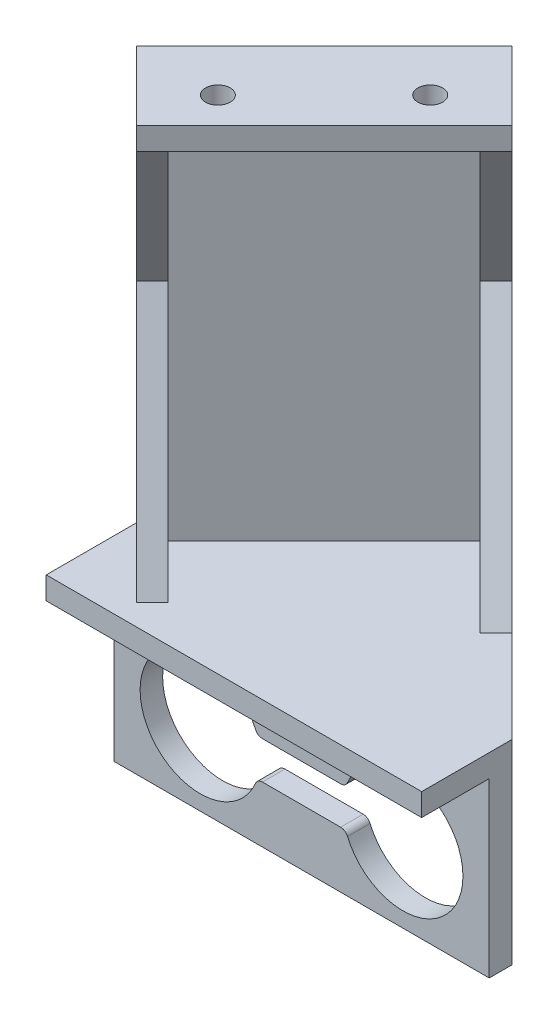
ISO-10303-21;
HEADER;
FILE_DESCRIPTION(('STEP AP214'),'2;1');
FILE_NAME('part.step','',(''),(''),'','','');
FILE_SCHEMA(('AUTOMOTIVE_DESIGN { 1 0 10303 214 1 1 1 1 }'));
ENDSEC;
DATA;
#1=APPLICATION_CONTEXT('core data for automotive mechanical design processes');
#2=APPLICATION_PROTOCOL_DEFINITION('international standard','automotive_design',2000,#1);
#3=PRODUCT_CONTEXT('',#1,'mechanical');
#4=PRODUCT('Part','Part','',(#3));
#5=PRODUCT_RELATED_PRODUCT_CATEGORY('part','',(#4));
#6=PRODUCT_DEFINITION_FORMATION('','',#4);
#7=PRODUCT_DEFINITION_CONTEXT('part definition',#1,'design');
#8=PRODUCT_DEFINITION('design','',#6,#7);
#9=PRODUCT_DEFINITION_SHAPE('','',#8);
#10=(LENGTH_UNIT() NAMED_UNIT(*) SI_UNIT(.MILLI.,.METRE.));
#11=(NAMED_UNIT(*) PLANE_ANGLE_UNIT() SI_UNIT($,.RADIAN.));
#12=(NAMED_UNIT(*) SI_UNIT($,.STERADIAN.) SOLID_ANGLE_UNIT());
#13=UNCERTAINTY_MEASURE_WITH_UNIT(LENGTH_MEASURE(1.E-05),#10,'distance_accuracy_value','');
#14=(GEOMETRIC_REPRESENTATION_CONTEXT(3) GLOBAL_UNCERTAINTY_ASSIGNED_CONTEXT((#13)) GLOBAL_UNIT_ASSIGNED_CONTEXT((#10,
#11,#12)) REPRESENTATION_CONTEXT('',''));
#15=CARTESIAN_POINT('',(0.,0.,0.));
#16=DIRECTION('',(0.,0.,1.));
#17=DIRECTION('',(1.,0.,0.));
#18=AXIS2_PLACEMENT_3D('',#15,#16,#17);
#19=CARTESIAN_POINT('',(2.12132034355976,71.,-22.8786796564402));
#20=DIRECTION('',(0.707106781186548,0.,0.707106781186547));
#21=DIRECTION('',(0.707106781186547,0.,-0.707106781186548));
#22=AXIS2_PLACEMENT_3D('',#19,#20,#21);
#23=PLANE('',#22);
#24=DIRECTION('',(0.707106781186547,0.,-0.707106781186548));
#25=VECTOR('',#24,1.);
#26=CARTESIAN_POINT('',(1.23165366794353E-13,68.,-20.7573593128806));
#27=LINE('',#26,#25);
#28=CARTESIAN_POINT('',(-20.7573593128806,68.,1.30537941567255E-13));
#29=VERTEX_POINT('',#28);
#30=CARTESIAN_POINT('',(1.22506171873482E-13,68.,-20.7573593128806));
#31=VERTEX_POINT('',#30);
#32=EDGE_CURVE('E300',#29,#31,#27,.T.);
#33=ORIENTED_EDGE('',*,*,#32,.F.);
#34=DIRECTION('',(0.,1.,0.));
#35=VECTOR('',#34,1.);
#36=CARTESIAN_POINT('',(-20.7573593128806,0.,1.22731685925359E-13));
#37=LINE('',#36,#35);
#38=CARTESIAN_POINT('',(-20.7573593128806,46.,1.24032728532342E-13));
#39=VERTEX_POINT('',#38);
#40=EDGE_CURVE('E571',#39,#29,#37,.T.);
#41=ORIENTED_EDGE('',*,*,#40,.F.);
#42=DIRECTION('',(0.,1.,0.));
#43=VECTOR('',#42,1.);
#44=CARTESIAN_POINT('',(-20.7573593128806,0.,1.22731685925359E-13));
#45=LINE('',#44,#43);
#46=CARTESIAN_POINT('',(-20.7573593128806,16.,1.27502175484295E-13));
#47=VERTEX_POINT('',#46);
#48=EDGE_CURVE('E561',#47,#39,#45,.T.);
#49=ORIENTED_EDGE('',*,*,#48,.F.);
#50=DIRECTION('',(-0.707106781186547,0.,0.707106781186548));
#51=VECTOR('',#50,1.);
#52=CARTESIAN_POINT('',(2.12132034355977,16.,-22.8786796564402));
#53=LINE('',#52,#51);
#54=CARTESIAN_POINT('',(0.,16.,-20.7573593128805));
#55=VERTEX_POINT('',#54);
#56=EDGE_CURVE('E308',#55,#47,#53,.T.);
#57=ORIENTED_EDGE('',*,*,#56,.F.);
#58=DIRECTION('',(0.,-1.,0.));
#59=VECTOR('',#58,1.);
#60=CARTESIAN_POINT('',(0.,0.,-20.7573593128805));
#61=LINE('',#60,#59);
#62=CARTESIAN_POINT('',(0.,46.,-20.7573593128805));
#63=VERTEX_POINT('',#62);
#64=EDGE_CURVE('E519',#63,#55,#61,.T.);
#65=ORIENTED_EDGE('',*,*,#64,.F.);
#66=DIRECTION('',(0.,-1.,0.));
#67=VECTOR('',#66,1.);
#68=CARTESIAN_POINT('',(0.,0.,-20.7573593128805));
#69=LINE('',#68,#67);
#70=EDGE_CURVE('E517',#31,#63,#69,.T.);
#71=ORIENTED_EDGE('',*,*,#70,.F.);
#72=EDGE_LOOP('',(#33,#41,#49,#57,#65,#71));
#73=FACE_BOUND('',#72,.T.);
#74=ADVANCED_FACE('F77',(#73),#23,.T.);
#75=CARTESIAN_POINT('',(7.0710678118656,68.,-13.6862915010151));
#76=DIRECTION('',(0.,1.,0.));
#77=DIRECTION('',(-1.,0.,0.));
#78=AXIS2_PLACEMENT_3D('',#75,#76,#77);
#79=PLANE('',#78);
#80=CARTESIAN_POINT('',(0.227922061357971,68.,-13.914213562373));
#81=DIRECTION('',(0.,-1.,0.));
#82=DIRECTION('',(0.,0.,-1.));
#83=AXIS2_PLACEMENT_3D('',#80,#81,#82);
#84=CIRCLE('',#83,1.65);
#85=CARTESIAN_POINT('',(0.227922061357971,68.,-15.564213562373));
#86=VERTEX_POINT('',#85);
#87=EDGE_CURVE('E590',#86,#86,#84,.T.);
#88=ORIENTED_EDGE('',*,*,#87,.F.);
#89=EDGE_LOOP('',(#88));
#90=FACE_BOUND('',#89,.T.);
#91=CARTESIAN_POINT('',(-13.914213562373,68.,0.227922061357981));
#92=DIRECTION('',(0.,-1.,0.));
#93=DIRECTION('',(0.,0.,-1.));
#94=AXIS2_PLACEMENT_3D('',#91,#92,#93);
#95=CIRCLE('',#94,1.65);
#96=CARTESIAN_POINT('',(-13.914213562373,68.,-1.42207793864202));
#97=VERTEX_POINT('',#96);
#98=EDGE_CURVE('E584',#97,#97,#95,.T.);
#99=ORIENTED_EDGE('',*,*,#98,.F.);
#100=EDGE_LOOP('',(#99));
#101=FACE_BOUND('',#100,.T.);
#102=DIRECTION('',(0.707106781186549,0.,0.707106781186547));
#103=VECTOR('',#102,1.);
#104=CARTESIAN_POINT('',(-10.3786796564403,68.,10.3786796564404));
#105=LINE('',#104,#103);
#106=CARTESIAN_POINT('',(-13.6862915010151,68.,7.0710678118656));
#107=VERTEX_POINT('',#106);
#108=EDGE_CURVE('E293',#29,#107,#105,.T.);
#109=ORIENTED_EDGE('',*,*,#108,.F.);
#110=ORIENTED_EDGE('',*,*,#32,.T.);
#111=DIRECTION('',(-0.707106781186548,0.,-0.707106781186547));
#112=VECTOR('',#111,1.);
#113=CARTESIAN_POINT('',(7.0710678118656,68.,-13.6862915010151));
#114=LINE('',#113,#112);
#115=CARTESIAN_POINT('',(7.0710678118656,68.,-13.6862915010151));
#116=VERTEX_POINT('',#115);
#117=EDGE_CURVE('E283',#116,#31,#114,.T.);
#118=ORIENTED_EDGE('',*,*,#117,.F.);
#119=DIRECTION('',(0.707106781186547,0.,-0.707106781186548));
#120=VECTOR('',#119,1.);
#121=CARTESIAN_POINT('',(7.0710678118656,68.,-13.6862915010151));
#122=LINE('',#121,#120);
#123=EDGE_CURVE('E284',#107,#116,#122,.T.);
#124=ORIENTED_EDGE('',*,*,#123,.F.);
#125=EDGE_LOOP('',(#109,#110,#118,#124));
#126=FACE_BOUND('',#125,.T.);
#127=ADVANCED_FACE('F605',(#90,#101,#126),#79,.F.);
#128=CARTESIAN_POINT('',(0.,16.,0.));
#129=DIRECTION('',(0.,1.,0.));
#130=DIRECTION('',(-1.,0.,0.));
#131=AXIS2_PLACEMENT_3D('',#128,#129,#130);
#132=PLANE('',#131);
#133=ORIENTED_EDGE('',*,*,#56,.T.);
#134=DIRECTION('',(0.707106781186549,0.,0.707106781186547));
#135=VECTOR('',#134,1.);
#136=CARTESIAN_POINT('',(-10.3786796564403,16.,10.3786796564404));
#137=LINE('',#136,#135);
#138=CARTESIAN_POINT('',(-13.6862915010151,16.,7.0710678118656));
#139=VERTEX_POINT('',#138);
#140=EDGE_CURVE('E92',#47,#139,#137,.T.);
#141=ORIENTED_EDGE('',*,*,#140,.T.);
#142=DIRECTION('',(-0.707106781186546,0.,0.707106781186548));
#143=VECTOR('',#142,1.);
#144=CARTESIAN_POINT('',(-13.6862915010151,16.,7.07106781186559));
#145=LINE('',#144,#143);
#146=CARTESIAN_POINT('',(-15.8076118445747,16.,9.19238815542524));
#147=VERTEX_POINT('',#146);
#148=EDGE_CURVE('E574',#139,#147,#145,.T.);
#149=ORIENTED_EDGE('',*,*,#148,.T.);
#150=DIRECTION('',(0.707106781186549,0.,0.707106781186546));
#151=VECTOR('',#150,1.);
#152=CARTESIAN_POINT('',(-25.,16.,0.));
#153=LINE('',#152,#151);
#154=CARTESIAN_POINT('',(-25.,16.,0.));
#155=VERTEX_POINT('',#154);
#156=EDGE_CURVE('E100',#155,#147,#153,.T.);
#157=ORIENTED_EDGE('',*,*,#156,.F.);
#158=DIRECTION('',(0.,0.,1.));
#159=VECTOR('',#158,1.);
#160=CARTESIAN_POINT('',(-25.,16.,0.));
#161=LINE('',#160,#159);
#162=CARTESIAN_POINT('',(-25.,16.,12.));
#163=VERTEX_POINT('',#162);
#164=EDGE_CURVE('E345',#155,#163,#161,.T.);
#165=ORIENTED_EDGE('',*,*,#164,.T.);
#166=DIRECTION('',(1.,0.,0.));
#167=VECTOR('',#166,1.);
#168=CARTESIAN_POINT('',(-25.,16.,12.));
#169=LINE('',#168,#167);
#170=CARTESIAN_POINT('',(25.,16.,12.));
#171=VERTEX_POINT('',#170);
#172=EDGE_CURVE('E348',#163,#171,#169,.T.);
#173=ORIENTED_EDGE('',*,*,#172,.T.);
#174=DIRECTION('',(0.,0.,-1.));
#175=VECTOR('',#174,1.);
#176=CARTESIAN_POINT('',(25.,16.,0.));
#177=LINE('',#176,#175);
#178=CARTESIAN_POINT('',(25.,16.,0.));
#179=VERTEX_POINT('',#178);
#180=EDGE_CURVE('E350',#171,#179,#177,.T.);
#181=ORIENTED_EDGE('',*,*,#180,.T.);
#182=DIRECTION('',(-0.707106781186551,0.,-0.707106781186544));
#183=VECTOR('',#182,1.);
#184=CARTESIAN_POINT('',(25.,16.,0.));
#185=LINE('',#184,#183);
#186=CARTESIAN_POINT('',(12.7279220613579,16.,-12.272077938642));
#187=VERTEX_POINT('',#186);
#188=EDGE_CURVE('E319',#179,#187,#185,.T.);
#189=ORIENTED_EDGE('',*,*,#188,.T.);
#190=DIRECTION('',(0.707106781186544,0.,-0.707106781186551));
#191=VECTOR('',#190,1.);
#192=CARTESIAN_POINT('',(10.6066017177983,16.,-10.1507575950823));
#193=LINE('',#192,#191);
#194=CARTESIAN_POINT('',(10.6066017177983,16.,-10.1507575950823));
#195=VERTEX_POINT('',#194);
#196=EDGE_CURVE('E305',#195,#187,#193,.T.);
#197=ORIENTED_EDGE('',*,*,#196,.F.);
#198=DIRECTION('',(0.707106781186551,0.,0.707106781186544));
#199=VECTOR('',#198,1.);
#200=CARTESIAN_POINT('',(10.3786796564402,16.,-10.3786796564403));
#201=LINE('',#200,#199);
#202=EDGE_CURVE('E537',#55,#195,#201,.T.);
#203=ORIENTED_EDGE('',*,*,#202,.F.);
#204=EDGE_LOOP('',(#133,#141,#149,#157,#165,#173,#181,#189,#197,#203));
#205=FACE_BOUND('',#204,.T.);
#206=ADVANCED_FACE('F492',(#205),#132,.T.);
#207=CARTESIAN_POINT('',(-25.,16.,12.));
#208=DIRECTION('',(0.,0.,-1.));
#209=DIRECTION('',(-1.,0.,0.));
#210=AXIS2_PLACEMENT_3D('',#207,#208,#209);
#211=PLANE('',#210);
#212=DIRECTION('',(-1.,0.,0.));
#213=VECTOR('',#212,1.);
#214=CARTESIAN_POINT('',(25.,13.,12.));
#215=LINE('',#214,#213);
#216=CARTESIAN_POINT('',(25.,13.,12.));
#217=VERTEX_POINT('',#216);
#218=CARTESIAN_POINT('',(-25.,13.,12.));
#219=VERTEX_POINT('',#218);
#220=EDGE_CURVE('E337',#217,#219,#215,.T.);
#221=ORIENTED_EDGE('',*,*,#220,.F.);
#222=DIRECTION('',(0.,-1.,0.));
#223=VECTOR('',#222,1.);
#224=CARTESIAN_POINT('',(25.,16.,12.));
#225=LINE('',#224,#223);
#226=EDGE_CURVE('E353',#171,#217,#225,.T.);
#227=ORIENTED_EDGE('',*,*,#226,.F.);
#228=ORIENTED_EDGE('',*,*,#172,.F.);
#229=DIRECTION('',(0.,-1.,0.));
#230=VECTOR('',#229,1.);
#231=CARTESIAN_POINT('',(-25.,16.,12.));
#232=LINE('',#231,#230);
#233=EDGE_CURVE('E356',#163,#219,#232,.T.);
#234=ORIENTED_EDGE('',*,*,#233,.T.);
#235=EDGE_LOOP('',(#221,#227,#228,#234));
#236=FACE_BOUND('',#235,.T.);
#237=ADVANCED_FACE('F498',(#236),#211,.F.);
#238=CARTESIAN_POINT('',(0.,0.,3.));
#239=DIRECTION('',(0.,0.,1.));
#240=DIRECTION('',(1.,0.,0.));
#241=AXIS2_PLACEMENT_3D('',#238,#239,#240);
#242=PLANE('',#241);
#243=DIRECTION('',(0.,-1.,0.));
#244=VECTOR('',#243,1.);
#245=CARTESIAN_POINT('',(-25.,-10.,3.));
#246=LINE('',#245,#244);
#247=CARTESIAN_POINT('',(-25.,13.,3.));
#248=VERTEX_POINT('',#247);
#249=CARTESIAN_POINT('',(-25.,-10.,3.));
#250=VERTEX_POINT('',#249);
#251=EDGE_CURVE('E450',#248,#250,#246,.T.);
#252=ORIENTED_EDGE('',*,*,#251,.T.);
#253=DIRECTION('',(1.,0.,0.));
#254=VECTOR('',#253,1.);
#255=CARTESIAN_POINT('',(25.,-10.,3.));
#256=LINE('',#255,#254);
#257=CARTESIAN_POINT('',(25.,-10.,3.));
#258=VERTEX_POINT('',#257);
#259=EDGE_CURVE('E453',#250,#258,#256,.T.);
#260=ORIENTED_EDGE('',*,*,#259,.T.);
#261=DIRECTION('',(0.,1.,0.));
#262=VECTOR('',#261,1.);
#263=CARTESIAN_POINT('',(25.,-10.,3.));
#264=LINE('',#263,#262);
#265=CARTESIAN_POINT('',(25.,13.,3.));
#266=VERTEX_POINT('',#265);
#267=EDGE_CURVE('E456',#258,#266,#264,.T.);
#268=ORIENTED_EDGE('',*,*,#267,.T.);
#269=DIRECTION('',(1.,0.,0.));
#270=VECTOR('',#269,1.);
#271=CARTESIAN_POINT('',(25.,13.,3.));
#272=LINE('',#271,#270);
#273=EDGE_CURVE('E342',#248,#266,#272,.T.);
#274=ORIENTED_EDGE('',*,*,#273,.F.);
#275=EDGE_LOOP('',(#252,#260,#268,#274));
#276=FACE_BOUND('',#275,.T.);
#277=CARTESIAN_POINT('',(13.5,0.,3.));
#278=DIRECTION('',(0.,0.,1.));
#279=DIRECTION('',(1.,0.,0.));
#280=AXIS2_PLACEMENT_3D('',#277,#278,#279);
#281=CIRCLE('',#280,8.);
#282=CARTESIAN_POINT('',(6.12972268809911,-3.11111111111111,3.));
#283=VERTEX_POINT('',#282);
#284=CARTESIAN_POINT('',(6.12972268809911,3.11111111111111,3.));
#285=VERTEX_POINT('',#284);
#286=EDGE_CURVE('E393',#283,#285,#281,.T.);
#287=ORIENTED_EDGE('',*,*,#286,.F.);
#288=CARTESIAN_POINT('',(5.2084380241115,-3.5,3.));
#289=DIRECTION('',(0.,0.,-1.));
#290=DIRECTION('',(-1.,0.,0.));
#291=AXIS2_PLACEMENT_3D('',#288,#289,#290);
#292=CIRCLE('',#291,1.);
#293=CARTESIAN_POINT('',(5.2084380241115,-2.5,3.));
#294=VERTEX_POINT('',#293);
#295=EDGE_CURVE('E391',#294,#283,#292,.T.);
#296=ORIENTED_EDGE('',*,*,#295,.F.);
#297=DIRECTION('',(1.,0.,0.));
#298=VECTOR('',#297,1.);
#299=CARTESIAN_POINT('',(5.2084380241115,-2.5,3.));
#300=LINE('',#299,#298);
#301=CARTESIAN_POINT('',(-5.2084380241115,-2.5,3.));
#302=VERTEX_POINT('',#301);
#303=EDGE_CURVE('E407',#302,#294,#300,.T.);
#304=ORIENTED_EDGE('',*,*,#303,.F.);
#305=CARTESIAN_POINT('',(-5.2084380241115,-3.5,3.));
#306=DIRECTION('',(0.,0.,-1.));
#307=DIRECTION('',(1.,0.,0.));
#308=AXIS2_PLACEMENT_3D('',#305,#306,#307);
#309=CIRCLE('',#308,1.);
#310=CARTESIAN_POINT('',(-6.12972268809911,-3.11111111111111,3.));
#311=VERTEX_POINT('',#310);
#312=EDGE_CURVE('E404',#311,#302,#309,.T.);
#313=ORIENTED_EDGE('',*,*,#312,.F.);
#314=CARTESIAN_POINT('',(-13.5,0.,3.));
#315=DIRECTION('',(0.,0.,1.));
#316=DIRECTION('',(1.,0.,0.));
#317=AXIS2_PLACEMENT_3D('',#314,#315,#316);
#318=CIRCLE('',#317,8.);
#319=CARTESIAN_POINT('',(-6.12972268809911,3.11111111111111,3.));
#320=VERTEX_POINT('',#319);
#321=EDGE_CURVE('E402',#320,#311,#318,.T.);
#322=ORIENTED_EDGE('',*,*,#321,.F.);
#323=CARTESIAN_POINT('',(-5.2084380241115,3.5,3.));
#324=DIRECTION('',(0.,0.,-1.));
#325=DIRECTION('',(-1.,0.,0.));
#326=AXIS2_PLACEMENT_3D('',#323,#324,#325);
#327=CIRCLE('',#326,1.);
#328=CARTESIAN_POINT('',(-5.2084380241115,2.5,3.));
#329=VERTEX_POINT('',#328);
#330=EDGE_CURVE('E400',#329,#320,#327,.T.);
#331=ORIENTED_EDGE('',*,*,#330,.F.);
#332=DIRECTION('',(-1.,0.,0.));
#333=VECTOR('',#332,1.);
#334=CARTESIAN_POINT('',(-5.2084380241115,2.5,3.));
#335=LINE('',#334,#333);
#336=CARTESIAN_POINT('',(5.2084380241115,2.5,3.));
#337=VERTEX_POINT('',#336);
#338=EDGE_CURVE('E398',#337,#329,#335,.T.);
#339=ORIENTED_EDGE('',*,*,#338,.F.);
#340=CARTESIAN_POINT('',(5.2084380241115,3.5,3.));
#341=DIRECTION('',(0.,0.,-1.));
#342=DIRECTION('',(1.,0.,0.));
#343=AXIS2_PLACEMENT_3D('',#340,#341,#342);
#344=CIRCLE('',#343,1.);
#345=EDGE_CURVE('E396',#285,#337,#344,.T.);
#346=ORIENTED_EDGE('',*,*,#345,.F.);
#347=EDGE_LOOP('',(#287,#296,#304,#313,#322,#331,#339,#346));
#348=FACE_BOUND('',#347,.T.);
#349=DIRECTION('',(-1.,0.,0.));
#350=VECTOR('',#349,1.);
#351=CARTESIAN_POINT('',(3.25,9.,3.));
#352=LINE('',#351,#350);
#353=CARTESIAN_POINT('',(3.25,9.,3.));
#354=VERTEX_POINT('',#353);
#355=CARTESIAN_POINT('',(-3.25,9.,3.));
#356=VERTEX_POINT('',#355);
#357=EDGE_CURVE('E362',#354,#356,#352,.T.);
#358=ORIENTED_EDGE('',*,*,#357,.F.);
#359=CARTESIAN_POINT('',(3.25,7.25,3.));
#360=DIRECTION('',(0.,0.,1.));
#361=DIRECTION('',(1.,0.,0.));
#362=AXIS2_PLACEMENT_3D('',#359,#360,#361);
#363=CIRCLE('',#362,1.75);
#364=CARTESIAN_POINT('',(3.25,5.5,3.));
#365=VERTEX_POINT('',#364);
#366=EDGE_CURVE('E360',#365,#354,#363,.T.);
#367=ORIENTED_EDGE('',*,*,#366,.F.);
#368=DIRECTION('',(1.,0.,0.));
#369=VECTOR('',#368,1.);
#370=CARTESIAN_POINT('',(3.25,5.5,3.));
#371=LINE('',#370,#369);
#372=CARTESIAN_POINT('',(-3.25,5.5,3.));
#373=VERTEX_POINT('',#372);
#374=EDGE_CURVE('E368',#373,#365,#371,.T.);
#375=ORIENTED_EDGE('',*,*,#374,.F.);
#376=CARTESIAN_POINT('',(-3.25,7.25,3.));
#377=DIRECTION('',(0.,0.,1.));
#378=DIRECTION('',(1.,0.,0.));
#379=AXIS2_PLACEMENT_3D('',#376,#377,#378);
#380=CIRCLE('',#379,1.75);
#381=EDGE_CURVE('E365',#356,#373,#380,.T.);
#382=ORIENTED_EDGE('',*,*,#381,.F.);
#383=EDGE_LOOP('',(#358,#367,#375,#382));
#384=FACE_BOUND('',#383,.T.);
#385=ADVANCED_FACE('F504',(#276,#348,#384),#242,.T.);
#386=CARTESIAN_POINT('',(0.,0.,0.));
#387=DIRECTION('',(0.,0.,1.));
#388=DIRECTION('',(1.,0.,0.));
#389=AXIS2_PLACEMENT_3D('',#386,#387,#388);
#390=PLANE('',#389);
#391=CARTESIAN_POINT('',(5.2084380241115,-3.5,0.));
#392=DIRECTION('',(0.,0.,-1.));
#393=DIRECTION('',(-1.,0.,0.));
#394=AXIS2_PLACEMENT_3D('',#391,#392,#393);
#395=CIRCLE('',#394,1.);
#396=CARTESIAN_POINT('',(5.2084380241115,-2.5,0.));
#397=VERTEX_POINT('',#396);
#398=CARTESIAN_POINT('',(6.12972268809911,-3.11111111111111,0.));
#399=VERTEX_POINT('',#398);
#400=EDGE_CURVE('E390',#397,#399,#395,.T.);
#401=ORIENTED_EDGE('',*,*,#400,.T.);
#402=CARTESIAN_POINT('',(13.5,0.,0.));
#403=DIRECTION('',(0.,0.,1.));
#404=DIRECTION('',(1.,0.,0.));
#405=AXIS2_PLACEMENT_3D('',#402,#403,#404);
#406=CIRCLE('',#405,8.);
#407=CARTESIAN_POINT('',(6.12972268809911,3.11111111111111,0.));
#408=VERTEX_POINT('',#407);
#409=EDGE_CURVE('E412',#399,#408,#406,.T.);
#410=ORIENTED_EDGE('',*,*,#409,.T.);
#411=CARTESIAN_POINT('',(5.2084380241115,3.5,0.));
#412=DIRECTION('',(0.,0.,-1.));
#413=DIRECTION('',(1.,0.,0.));
#414=AXIS2_PLACEMENT_3D('',#411,#412,#413);
#415=CIRCLE('',#414,1.);
#416=CARTESIAN_POINT('',(5.2084380241115,2.5,0.));
#417=VERTEX_POINT('',#416);
#418=EDGE_CURVE('E415',#408,#417,#415,.T.);
#419=ORIENTED_EDGE('',*,*,#418,.T.);
#420=DIRECTION('',(-1.,0.,0.));
#421=VECTOR('',#420,1.);
#422=CARTESIAN_POINT('',(-5.2084380241115,2.5,0.));
#423=LINE('',#422,#421);
#424=CARTESIAN_POINT('',(-5.2084380241115,2.5,0.));
#425=VERTEX_POINT('',#424);
#426=EDGE_CURVE('E418',#417,#425,#423,.T.);
#427=ORIENTED_EDGE('',*,*,#426,.T.);
#428=CARTESIAN_POINT('',(-5.2084380241115,3.5,0.));
#429=DIRECTION('',(0.,0.,-1.));
#430=DIRECTION('',(-1.,0.,0.));
#431=AXIS2_PLACEMENT_3D('',#428,#429,#430);
#432=CIRCLE('',#431,1.);
#433=CARTESIAN_POINT('',(-6.12972268809911,3.11111111111111,0.));
#434=VERTEX_POINT('',#433);
#435=EDGE_CURVE('E421',#425,#434,#432,.T.);
#436=ORIENTED_EDGE('',*,*,#435,.T.);
#437=CARTESIAN_POINT('',(-13.5,0.,0.));
#438=DIRECTION('',(0.,0.,1.));
#439=DIRECTION('',(1.,0.,0.));
#440=AXIS2_PLACEMENT_3D('',#437,#438,#439);
#441=CIRCLE('',#440,8.);
#442=CARTESIAN_POINT('',(-6.12972268809911,-3.11111111111111,0.));
#443=VERTEX_POINT('',#442);
#444=EDGE_CURVE('E424',#434,#443,#441,.T.);
#445=ORIENTED_EDGE('',*,*,#444,.T.);
#446=CARTESIAN_POINT('',(-5.2084380241115,-3.5,0.));
#447=DIRECTION('',(0.,0.,-1.));
#448=DIRECTION('',(1.,0.,0.));
#449=AXIS2_PLACEMENT_3D('',#446,#447,#448);
#450=CIRCLE('',#449,1.);
#451=CARTESIAN_POINT('',(-5.2084380241115,-2.5,0.));
#452=VERTEX_POINT('',#451);
#453=EDGE_CURVE('E427',#443,#452,#450,.T.);
#454=ORIENTED_EDGE('',*,*,#453,.T.);
#455=DIRECTION('',(1.,0.,0.));
#456=VECTOR('',#455,1.);
#457=CARTESIAN_POINT('',(5.2084380241115,-2.5,0.));
#458=LINE('',#457,#456);
#459=EDGE_CURVE('E394',#452,#397,#458,.T.);
#460=ORIENTED_EDGE('',*,*,#459,.T.);
#461=EDGE_LOOP('',(#401,#410,#419,#427,#436,#445,#454,#460));
#462=FACE_BOUND('',#461,.T.);
#463=DIRECTION('',(0.,-1.,0.));
#464=VECTOR('',#463,1.);
#465=CARTESIAN_POINT('',(-25.,-10.,0.));
#466=LINE('',#465,#464);
#467=CARTESIAN_POINT('',(-25.,13.,0.));
#468=VERTEX_POINT('',#467);
#469=CARTESIAN_POINT('',(-25.,-10.,0.));
#470=VERTEX_POINT('',#469);
#471=EDGE_CURVE('E449',#468,#470,#466,.T.);
#472=ORIENTED_EDGE('',*,*,#471,.F.);
#473=DIRECTION('',(1.,0.,0.));
#474=VECTOR('',#473,1.);
#475=CARTESIAN_POINT('',(25.,13.,0.));
#476=LINE('',#475,#474);
#477=CARTESIAN_POINT('',(25.,13.,0.));
#478=VERTEX_POINT('',#477);
#479=EDGE_CURVE('E320',#468,#478,#476,.T.);
#480=ORIENTED_EDGE('',*,*,#479,.T.);
#481=DIRECTION('',(0.,1.,0.));
#482=VECTOR('',#481,1.);
#483=CARTESIAN_POINT('',(25.,-10.,0.));
#484=LINE('',#483,#482);
#485=CARTESIAN_POINT('',(25.,-10.,0.));
#486=VERTEX_POINT('',#485);
#487=EDGE_CURVE('E454',#486,#478,#484,.T.);
#488=ORIENTED_EDGE('',*,*,#487,.F.);
#489=DIRECTION('',(1.,0.,0.));
#490=VECTOR('',#489,1.);
#491=CARTESIAN_POINT('',(25.,-10.,0.));
#492=LINE('',#491,#490);
#493=EDGE_CURVE('E461',#470,#486,#492,.T.);
#494=ORIENTED_EDGE('',*,*,#493,.F.);
#495=EDGE_LOOP('',(#472,#480,#488,#494));
#496=FACE_BOUND('',#495,.T.);
#497=CARTESIAN_POINT('',(3.25,7.25,0.));
#498=DIRECTION('',(0.,0.,1.));
#499=DIRECTION('',(1.,0.,0.));
#500=AXIS2_PLACEMENT_3D('',#497,#498,#499);
#501=CIRCLE('',#500,1.75);
#502=CARTESIAN_POINT('',(3.25,5.5,0.));
#503=VERTEX_POINT('',#502);
#504=CARTESIAN_POINT('',(3.25,9.,0.));
#505=VERTEX_POINT('',#504);
#506=EDGE_CURVE('E359',#503,#505,#501,.T.);
#507=ORIENTED_EDGE('',*,*,#506,.T.);
#508=DIRECTION('',(-1.,0.,0.));
#509=VECTOR('',#508,1.);
#510=CARTESIAN_POINT('',(3.25,9.,0.));
#511=LINE('',#510,#509);
#512=CARTESIAN_POINT('',(-3.25,9.,0.));
#513=VERTEX_POINT('',#512);
#514=EDGE_CURVE('E373',#505,#513,#511,.T.);
#515=ORIENTED_EDGE('',*,*,#514,.T.);
#516=CARTESIAN_POINT('',(-3.25,7.25,0.));
#517=DIRECTION('',(0.,0.,1.));
#518=DIRECTION('',(1.,0.,0.));
#519=AXIS2_PLACEMENT_3D('',#516,#517,#518);
#520=CIRCLE('',#519,1.75);
#521=CARTESIAN_POINT('',(-3.25,5.5,0.));
#522=VERTEX_POINT('',#521);
#523=EDGE_CURVE('E376',#513,#522,#520,.T.);
#524=ORIENTED_EDGE('',*,*,#523,.T.);
#525=DIRECTION('',(1.,0.,0.));
#526=VECTOR('',#525,1.);
#527=CARTESIAN_POINT('',(3.25,5.5,0.));
#528=LINE('',#527,#526);
#529=EDGE_CURVE('E363',#522,#503,#528,.T.);
#530=ORIENTED_EDGE('',*,*,#529,.T.);
#531=EDGE_LOOP('',(#507,#515,#524,#530));
#532=FACE_BOUND('',#531,.T.);
#533=ADVANCED_FACE('F475',(#462,#496,#532),#390,.F.);
#534=CARTESIAN_POINT('',(-25.,-10.,3.));
#535=DIRECTION('',(1.,0.,0.));
#536=DIRECTION('',(0.,0.,-1.));
#537=AXIS2_PLACEMENT_3D('',#534,#535,#536);
#538=PLANE('',#537);
#539=ORIENTED_EDGE('',*,*,#251,.F.);
#540=DIRECTION('',(0.,0.,-1.));
#541=VECTOR('',#540,1.);
#542=CARTESIAN_POINT('',(-25.,13.,3.));
#543=LINE('',#542,#541);
#544=EDGE_CURVE('E339',#219,#248,#543,.T.);
#545=ORIENTED_EDGE('',*,*,#544,.F.);
#546=ORIENTED_EDGE('',*,*,#233,.F.);
#547=ORIENTED_EDGE('',*,*,#164,.F.);
#548=EDGE_CURVE('E458',#155,#468,#466,.T.);
#549=ORIENTED_EDGE('',*,*,#548,.T.);
#550=ORIENTED_EDGE('',*,*,#471,.T.);
#551=DIRECTION('',(0.,0.,-1.));
#552=VECTOR('',#551,1.);
#553=CARTESIAN_POINT('',(-25.,-10.,3.));
#554=LINE('',#553,#552);
#555=EDGE_CURVE('E12',#250,#470,#554,.T.);
#556=ORIENTED_EDGE('',*,*,#555,.F.);
#557=EDGE_LOOP('',(#539,#545,#546,#547,#549,#550,#556));
#558=FACE_BOUND('',#557,.T.);
#559=ADVANCED_FACE('F79',(#558),#538,.F.);
#560=CARTESIAN_POINT('',(25.,-10.,3.));
#561=DIRECTION('',(0.,1.,0.));
#562=DIRECTION('',(-1.,0.,0.));
#563=AXIS2_PLACEMENT_3D('',#560,#561,#562);
#564=PLANE('',#563);
#565=ORIENTED_EDGE('',*,*,#493,.T.);
#566=DIRECTION('',(0.,0.,-1.));
#567=VECTOR('',#566,1.);
#568=CARTESIAN_POINT('',(25.,-10.,3.));
#569=LINE('',#568,#567);
#570=EDGE_CURVE('E85',#258,#486,#569,.T.);
#571=ORIENTED_EDGE('',*,*,#570,.F.);
#572=ORIENTED_EDGE('',*,*,#259,.F.);
#573=ORIENTED_EDGE('',*,*,#555,.T.);
#574=EDGE_LOOP('',(#565,#571,#572,#573));
#575=FACE_BOUND('',#574,.T.);
#576=ADVANCED_FACE('F507',(#575),#564,.F.);
#577=CARTESIAN_POINT('',(25.,-10.,3.));
#578=DIRECTION('',(-1.,0.,0.));
#579=DIRECTION('',(0.,0.,1.));
#580=AXIS2_PLACEMENT_3D('',#577,#578,#579);
#581=PLANE('',#580);
#582=DIRECTION('',(0.,0.,1.));
#583=VECTOR('',#582,1.);
#584=CARTESIAN_POINT('',(25.,13.,3.));
#585=LINE('',#584,#583);
#586=EDGE_CURVE('E333',#266,#217,#585,.T.);
#587=ORIENTED_EDGE('',*,*,#586,.F.);
#588=ORIENTED_EDGE('',*,*,#267,.F.);
#589=ORIENTED_EDGE('',*,*,#570,.T.);
#590=ORIENTED_EDGE('',*,*,#487,.T.);
#591=DIRECTION('',(0.,1.,0.));
#592=VECTOR('',#591,1.);
#593=CARTESIAN_POINT('',(25.,13.,0.));
#594=LINE('',#593,#592);
#595=EDGE_CURVE('E329',#478,#179,#594,.T.);
#596=ORIENTED_EDGE('',*,*,#595,.T.);
#597=ORIENTED_EDGE('',*,*,#180,.F.);
#598=ORIENTED_EDGE('',*,*,#226,.T.);
#599=EDGE_LOOP('',(#587,#588,#589,#590,#596,#597,#598));
#600=FACE_BOUND('',#599,.T.);
#601=ADVANCED_FACE('F470',(#600),#581,.F.);
#602=CARTESIAN_POINT('',(5.2084380241115,-3.5,3.));
#603=DIRECTION('',(0.,0.,-1.));
#604=DIRECTION('',(-1.,0.,0.));
#605=AXIS2_PLACEMENT_3D('',#602,#603,#604);
#606=CYLINDRICAL_SURFACE('',#605,1.);
#607=ORIENTED_EDGE('',*,*,#400,.F.);
#608=DIRECTION('',(0.,0.,-1.));
#609=VECTOR('',#608,1.);
#610=CARTESIAN_POINT('',(5.2084380241115,-2.5,3.));
#611=LINE('',#610,#609);
#612=EDGE_CURVE('E409',#294,#397,#611,.T.);
#613=ORIENTED_EDGE('',*,*,#612,.F.);
#614=ORIENTED_EDGE('',*,*,#295,.T.);
#615=DIRECTION('',(0.,0.,-1.));
#616=VECTOR('',#615,1.);
#617=CARTESIAN_POINT('',(6.12972268809911,-3.11111111111111,3.));
#618=LINE('',#617,#616);
#619=EDGE_CURVE('E446',#283,#399,#618,.T.);
#620=ORIENTED_EDGE('',*,*,#619,.T.);
#621=EDGE_LOOP('',(#607,#613,#614,#620));
#622=FACE_BOUND('',#621,.T.);
#623=ADVANCED_FACE('F683',(#622),#606,.T.);
#624=CARTESIAN_POINT('',(13.5,0.,3.));
#625=DIRECTION('',(0.,0.,-1.));
#626=DIRECTION('',(-1.,0.,0.));
#627=AXIS2_PLACEMENT_3D('',#624,#625,#626);
#628=CYLINDRICAL_SURFACE('',#627,8.);
#629=ORIENTED_EDGE('',*,*,#409,.F.);
#630=ORIENTED_EDGE('',*,*,#619,.F.);
#631=ORIENTED_EDGE('',*,*,#286,.T.);
#632=DIRECTION('',(0.,0.,-1.));
#633=VECTOR('',#632,1.);
#634=CARTESIAN_POINT('',(6.12972268809911,3.11111111111111,3.));
#635=LINE('',#634,#633);
#636=EDGE_CURVE('E444',#285,#408,#635,.T.);
#637=ORIENTED_EDGE('',*,*,#636,.T.);
#638=EDGE_LOOP('',(#629,#630,#631,#637));
#639=FACE_BOUND('',#638,.T.);
#640=ADVANCED_FACE('F679',(#639),#628,.F.);
#641=CARTESIAN_POINT('',(5.2084380241115,3.5,3.));
#642=DIRECTION('',(0.,0.,-1.));
#643=DIRECTION('',(-1.,0.,0.));
#644=AXIS2_PLACEMENT_3D('',#641,#642,#643);
#645=CYLINDRICAL_SURFACE('',#644,1.);
#646=ORIENTED_EDGE('',*,*,#418,.F.);
#647=ORIENTED_EDGE('',*,*,#636,.F.);
#648=ORIENTED_EDGE('',*,*,#345,.T.);
#649=DIRECTION('',(0.,0.,-1.));
#650=VECTOR('',#649,1.);
#651=CARTESIAN_POINT('',(5.2084380241115,2.5,3.));
#652=LINE('',#651,#650);
#653=EDGE_CURVE('E442',#337,#417,#652,.T.);
#654=ORIENTED_EDGE('',*,*,#653,.T.);
#655=EDGE_LOOP('',(#646,#647,#648,#654));
#656=FACE_BOUND('',#655,.T.);
#657=ADVANCED_FACE('F675',(#656),#645,.T.);
#658=CARTESIAN_POINT('',(-5.2084380241115,2.5,3.));
#659=DIRECTION('',(0.,-1.,0.));
#660=DIRECTION('',(0.,0.,-1.));
#661=AXIS2_PLACEMENT_3D('',#658,#659,#660);
#662=PLANE('',#661);
#663=ORIENTED_EDGE('',*,*,#426,.F.);
#664=ORIENTED_EDGE('',*,*,#653,.F.);
#665=ORIENTED_EDGE('',*,*,#338,.T.);
#666=DIRECTION('',(0.,0.,-1.));
#667=VECTOR('',#666,1.);
#668=CARTESIAN_POINT('',(-5.2084380241115,2.5,3.));
#669=LINE('',#668,#667);
#670=EDGE_CURVE('E440',#329,#425,#669,.T.);
#671=ORIENTED_EDGE('',*,*,#670,.T.);
#672=EDGE_LOOP('',(#663,#664,#665,#671));
#673=FACE_BOUND('',#672,.T.);
#674=ADVANCED_FACE('F671',(#673),#662,.T.);
#675=CARTESIAN_POINT('',(-5.2084380241115,3.5,3.));
#676=DIRECTION('',(0.,0.,-1.));
#677=DIRECTION('',(-1.,0.,0.));
#678=AXIS2_PLACEMENT_3D('',#675,#676,#677);
#679=CYLINDRICAL_SURFACE('',#678,1.);
#680=ORIENTED_EDGE('',*,*,#435,.F.);
#681=ORIENTED_EDGE('',*,*,#670,.F.);
#682=ORIENTED_EDGE('',*,*,#330,.T.);
#683=DIRECTION('',(0.,0.,-1.));
#684=VECTOR('',#683,1.);
#685=CARTESIAN_POINT('',(-6.12972268809911,3.11111111111111,3.));
#686=LINE('',#685,#684);
#687=EDGE_CURVE('E438',#320,#434,#686,.T.);
#688=ORIENTED_EDGE('',*,*,#687,.T.);
#689=EDGE_LOOP('',(#680,#681,#682,#688));
#690=FACE_BOUND('',#689,.T.);
#691=ADVANCED_FACE('F667',(#690),#679,.T.);
#692=CARTESIAN_POINT('',(-13.5,0.,3.));
#693=DIRECTION('',(0.,0.,-1.));
#694=DIRECTION('',(-1.,0.,0.));
#695=AXIS2_PLACEMENT_3D('',#692,#693,#694);
#696=CYLINDRICAL_SURFACE('',#695,8.);
#697=ORIENTED_EDGE('',*,*,#444,.F.);
#698=ORIENTED_EDGE('',*,*,#687,.F.);
#699=ORIENTED_EDGE('',*,*,#321,.T.);
#700=DIRECTION('',(0.,0.,-1.));
#701=VECTOR('',#700,1.);
#702=CARTESIAN_POINT('',(-6.12972268809911,-3.11111111111111,3.));
#703=LINE('',#702,#701);
#704=EDGE_CURVE('E436',#311,#443,#703,.T.);
#705=ORIENTED_EDGE('',*,*,#704,.T.);
#706=EDGE_LOOP('',(#697,#698,#699,#705));
#707=FACE_BOUND('',#706,.T.);
#708=ADVANCED_FACE('F663',(#707),#696,.F.);
#709=CARTESIAN_POINT('',(-5.2084380241115,-3.5,3.));
#710=DIRECTION('',(0.,0.,-1.));
#711=DIRECTION('',(-1.,0.,0.));
#712=AXIS2_PLACEMENT_3D('',#709,#710,#711);
#713=CYLINDRICAL_SURFACE('',#712,1.);
#714=ORIENTED_EDGE('',*,*,#453,.F.);
#715=ORIENTED_EDGE('',*,*,#704,.F.);
#716=ORIENTED_EDGE('',*,*,#312,.T.);
#717=DIRECTION('',(0.,0.,-1.));
#718=VECTOR('',#717,1.);
#719=CARTESIAN_POINT('',(-5.2084380241115,-2.5,3.));
#720=LINE('',#719,#718);
#721=EDGE_CURVE('E434',#302,#452,#720,.T.);
#722=ORIENTED_EDGE('',*,*,#721,.T.);
#723=EDGE_LOOP('',(#714,#715,#716,#722));
#724=FACE_BOUND('',#723,.T.);
#725=ADVANCED_FACE('F659',(#724),#713,.T.);
#726=CARTESIAN_POINT('',(5.2084380241115,-2.5,3.));
#727=DIRECTION('',(0.,1.,0.));
#728=DIRECTION('',(-1.,0.,0.));
#729=AXIS2_PLACEMENT_3D('',#726,#727,#728);
#730=PLANE('',#729);
#731=ORIENTED_EDGE('',*,*,#459,.F.);
#732=ORIENTED_EDGE('',*,*,#721,.F.);
#733=ORIENTED_EDGE('',*,*,#303,.T.);
#734=ORIENTED_EDGE('',*,*,#612,.T.);
#735=EDGE_LOOP('',(#731,#732,#733,#734));
#736=FACE_BOUND('',#735,.T.);
#737=ADVANCED_FACE('F655',(#736),#730,.T.);
#738=CARTESIAN_POINT('',(3.25,7.25,3.));
#739=DIRECTION('',(0.,0.,-1.));
#740=DIRECTION('',(-1.,0.,0.));
#741=AXIS2_PLACEMENT_3D('',#738,#739,#740);
#742=CYLINDRICAL_SURFACE('',#741,1.75);
#743=ORIENTED_EDGE('',*,*,#506,.F.);
#744=DIRECTION('',(0.,0.,-1.));
#745=VECTOR('',#744,1.);
#746=CARTESIAN_POINT('',(3.25,5.5,3.));
#747=LINE('',#746,#745);
#748=EDGE_CURVE('E370',#365,#503,#747,.T.);
#749=ORIENTED_EDGE('',*,*,#748,.F.);
#750=ORIENTED_EDGE('',*,*,#366,.T.);
#751=DIRECTION('',(0.,0.,-1.));
#752=VECTOR('',#751,1.);
#753=CARTESIAN_POINT('',(3.25,9.,3.));
#754=LINE('',#753,#752);
#755=EDGE_CURVE('E387',#354,#505,#754,.T.);
#756=ORIENTED_EDGE('',*,*,#755,.T.);
#757=EDGE_LOOP('',(#743,#749,#750,#756));
#758=FACE_BOUND('',#757,.T.);
#759=ADVANCED_FACE('F651',(#758),#742,.F.);
#760=CARTESIAN_POINT('',(3.25,9.,3.));
#761=DIRECTION('',(0.,-1.,0.));
#762=DIRECTION('',(1.,0.,0.));
#763=AXIS2_PLACEMENT_3D('',#760,#761,#762);
#764=PLANE('',#763);
#765=ORIENTED_EDGE('',*,*,#514,.F.);
#766=ORIENTED_EDGE('',*,*,#755,.F.);
#767=ORIENTED_EDGE('',*,*,#357,.T.);
#768=DIRECTION('',(0.,0.,-1.));
#769=VECTOR('',#768,1.);
#770=CARTESIAN_POINT('',(-3.25,9.,3.));
#771=LINE('',#770,#769);
#772=EDGE_CURVE('E385',#356,#513,#771,.T.);
#773=ORIENTED_EDGE('',*,*,#772,.T.);
#774=EDGE_LOOP('',(#765,#766,#767,#773));
#775=FACE_BOUND('',#774,.T.);
#776=ADVANCED_FACE('F647',(#775),#764,.T.);
#777=CARTESIAN_POINT('',(-3.25,7.25,3.));
#778=DIRECTION('',(0.,0.,-1.));
#779=DIRECTION('',(-1.,0.,0.));
#780=AXIS2_PLACEMENT_3D('',#777,#778,#779);
#781=CYLINDRICAL_SURFACE('',#780,1.75);
#782=ORIENTED_EDGE('',*,*,#523,.F.);
#783=ORIENTED_EDGE('',*,*,#772,.F.);
#784=ORIENTED_EDGE('',*,*,#381,.T.);
#785=DIRECTION('',(0.,0.,-1.));
#786=VECTOR('',#785,1.);
#787=CARTESIAN_POINT('',(-3.25,5.5,3.));
#788=LINE('',#787,#786);
#789=EDGE_CURVE('E383',#373,#522,#788,.T.);
#790=ORIENTED_EDGE('',*,*,#789,.T.);
#791=EDGE_LOOP('',(#782,#783,#784,#790));
#792=FACE_BOUND('',#791,.T.);
#793=ADVANCED_FACE('F643',(#792),#781,.F.);
#794=CARTESIAN_POINT('',(3.25,5.5,3.));
#795=DIRECTION('',(0.,1.,0.));
#796=DIRECTION('',(0.,0.,1.));
#797=AXIS2_PLACEMENT_3D('',#794,#795,#796);
#798=PLANE('',#797);
#799=ORIENTED_EDGE('',*,*,#529,.F.);
#800=ORIENTED_EDGE('',*,*,#789,.F.);
#801=ORIENTED_EDGE('',*,*,#374,.T.);
#802=ORIENTED_EDGE('',*,*,#748,.T.);
#803=EDGE_LOOP('',(#799,#800,#801,#802));
#804=FACE_BOUND('',#803,.T.);
#805=ADVANCED_FACE('F636',(#804),#798,.T.);
#806=CARTESIAN_POINT('',(0.,13.,0.));
#807=DIRECTION('',(0.,-1.,0.));
#808=DIRECTION('',(1.,0.,0.));
#809=AXIS2_PLACEMENT_3D('',#806,#807,#808);
#810=PLANE('',#809);
#811=ORIENTED_EDGE('',*,*,#586,.T.);
#812=ORIENTED_EDGE('',*,*,#220,.T.);
#813=ORIENTED_EDGE('',*,*,#544,.T.);
#814=ORIENTED_EDGE('',*,*,#273,.T.);
#815=EDGE_LOOP('',(#811,#812,#813,#814));
#816=FACE_BOUND('',#815,.T.);
#817=ADVANCED_FACE('F500',(#816),#810,.T.);
#818=CARTESIAN_POINT('',(0.,13.,-24.9999999999997));
#819=DIRECTION('',(-0.707106781186544,0.,-0.707106781186551));
#820=DIRECTION('',(-0.707106781186551,0.,0.707106781186544));
#821=AXIS2_PLACEMENT_3D('',#818,#819,#820);
#822=PLANE('',#821);
#823=ORIENTED_EDGE('',*,*,#548,.F.);
#824=DIRECTION('',(0.,-1.,0.));
#825=VECTOR('',#824,1.);
#826=CARTESIAN_POINT('',(-25.,71.,0.));
#827=LINE('',#826,#825);
#828=CARTESIAN_POINT('',(-25.,71.,0.));
#829=VERTEX_POINT('',#828);
#830=EDGE_CURVE('E315',#829,#155,#827,.T.);
#831=ORIENTED_EDGE('',*,*,#830,.F.);
#832=DIRECTION('',(-0.707106781186551,0.,0.707106781186544));
#833=VECTOR('',#832,1.);
#834=CARTESIAN_POINT('',(0.,71.,-24.9999999999997));
#835=LINE('',#834,#833);
#836=CARTESIAN_POINT('',(0.,71.,-24.9999999999997));
#837=VERTEX_POINT('',#836);
#838=EDGE_CURVE('E313',#837,#829,#835,.T.);
#839=ORIENTED_EDGE('',*,*,#838,.F.);
#840=DIRECTION('',(0.,1.,0.));
#841=VECTOR('',#840,1.);
#842=CARTESIAN_POINT('',(0.,13.,-24.9999999999997));
#843=LINE('',#842,#841);
#844=CARTESIAN_POINT('',(0.,13.,-24.9999999999997));
#845=VERTEX_POINT('',#844);
#846=EDGE_CURVE('E331',#845,#837,#843,.T.);
#847=ORIENTED_EDGE('',*,*,#846,.F.);
#848=DIRECTION('',(-0.707106781186551,0.,0.707106781186544));
#849=VECTOR('',#848,1.);
#850=CARTESIAN_POINT('',(0.,13.,-24.9999999999997));
#851=LINE('',#850,#849);
#852=EDGE_CURVE('E326',#845,#468,#851,.T.);
#853=ORIENTED_EDGE('',*,*,#852,.T.);
#854=EDGE_LOOP('',(#823,#831,#839,#847,#853));
#855=FACE_BOUND('',#854,.T.);
#856=ADVANCED_FACE('F483',(#855),#822,.T.);
#857=CARTESIAN_POINT('',(25.,13.,0.));
#858=DIRECTION('',(0.707106781186544,0.,-0.707106781186551));
#859=DIRECTION('',(-0.707106781186551,0.,-0.707106781186544));
#860=AXIS2_PLACEMENT_3D('',#857,#858,#859);
#861=PLANE('',#860);
#862=ORIENTED_EDGE('',*,*,#188,.F.);
#863=ORIENTED_EDGE('',*,*,#595,.F.);
#864=DIRECTION('',(-0.707106781186551,0.,-0.707106781186544));
#865=VECTOR('',#864,1.);
#866=CARTESIAN_POINT('',(25.,13.,0.));
#867=LINE('',#866,#865);
#868=EDGE_CURVE('E323',#478,#845,#867,.T.);
#869=ORIENTED_EDGE('',*,*,#868,.T.);
#870=ORIENTED_EDGE('',*,*,#846,.T.);
#871=DIRECTION('',(0.707106781186591,0.,0.707106781186504));
#872=VECTOR('',#871,1.);
#873=CARTESIAN_POINT('',(0.,71.,-24.9999999999997));
#874=LINE('',#873,#872);
#875=CARTESIAN_POINT('',(9.19238815542515,71.,-15.8076118445747));
#876=VERTEX_POINT('',#875);
#877=EDGE_CURVE('E309',#837,#876,#874,.T.);
#878=ORIENTED_EDGE('',*,*,#877,.T.);
#879=DIRECTION('',(0.,-1.,0.));
#880=VECTOR('',#879,1.);
#881=CARTESIAN_POINT('',(9.19238815542516,0.,-15.8076118445747));
#882=LINE('',#881,#880);
#883=CARTESIAN_POINT('',(9.19238815542516,68.,-15.8076118445747));
#884=VERTEX_POINT('',#883);
#885=EDGE_CURVE('E513',#876,#884,#882,.T.);
#886=ORIENTED_EDGE('',*,*,#885,.T.);
#887=DIRECTION('',(0.292602867990328,0.910366477462605,0.292602867990325));
#888=VECTOR('',#887,1.);
#889=CARTESIAN_POINT('',(-8.35479722487166,13.4059713981609,-33.3547972248713));
#890=LINE('',#889,#888);
#891=CARTESIAN_POINT('',(2.12132034355965,46.,-22.8786796564401));
#892=VERTEX_POINT('',#891);
#893=EDGE_CURVE('E515',#892,#884,#890,.T.);
#894=ORIENTED_EDGE('',*,*,#893,.F.);
#895=DIRECTION('',(0.31622776601684,-0.894427190999916,0.316227766016836));
#896=VECTOR('',#895,1.);
#897=CARTESIAN_POINT('',(17.2078210486802,3.32893218813463,-7.79217895131969));
#898=LINE('',#897,#896);
#899=EDGE_CURVE('E516',#892,#187,#898,.T.);
#900=ORIENTED_EDGE('',*,*,#899,.T.);
#901=EDGE_LOOP('',(#862,#863,#869,#870,#878,#886,#894,#900));
#902=FACE_BOUND('',#901,.T.);
#903=ADVANCED_FACE('F489',(#902),#861,.T.);
#904=CARTESIAN_POINT('',(0.,13.,0.));
#905=DIRECTION('',(0.,1.,0.));
#906=DIRECTION('',(-1.,0.,0.));
#907=AXIS2_PLACEMENT_3D('',#904,#905,#906);
#908=PLANE('',#907);
#909=ORIENTED_EDGE('',*,*,#479,.F.);
#910=ORIENTED_EDGE('',*,*,#852,.F.);
#911=ORIENTED_EDGE('',*,*,#868,.F.);
#912=EDGE_LOOP('',(#909,#910,#911));
#913=FACE_BOUND('',#912,.T.);
#914=ADVANCED_FACE('F479',(#913),#908,.F.);
#915=CARTESIAN_POINT('',(-25.,71.,0.));
#916=DIRECTION('',(0.707106781186546,0.,-0.707106781186549));
#917=DIRECTION('',(-0.707106781186549,0.,-0.707106781186546));
#918=AXIS2_PLACEMENT_3D('',#915,#916,#917);
#919=PLANE('',#918);
#920=DIRECTION('',(-0.22360679774998,0.948683298050514,-0.223606797749979));
#921=VECTOR('',#920,1.);
#922=CARTESIAN_POINT('',(-12.0827381104218,0.196699141100942,12.9172618895781));
#923=LINE('',#922,#921);
#924=CARTESIAN_POINT('',(-22.8786796564402,46.,2.12132034355977));
#925=VERTEX_POINT('',#924);
#926=EDGE_CURVE('E292',#147,#925,#923,.T.);
#927=ORIENTED_EDGE('',*,*,#926,.T.);
#928=DIRECTION('',(0.292602867990327,0.910366477462605,0.292602867990326));
#929=VECTOR('',#928,1.);
#930=CARTESIAN_POINT('',(-33.3547972248715,13.4059713981609,-8.35479722487145));
#931=LINE('',#930,#929);
#932=CARTESIAN_POINT('',(-15.8076118445747,68.,9.19238815542524));
#933=VERTEX_POINT('',#932);
#934=EDGE_CURVE('E276',#925,#933,#931,.T.);
#935=ORIENTED_EDGE('',*,*,#934,.T.);
#936=DIRECTION('',(0.,-1.,0.));
#937=VECTOR('',#936,1.);
#938=CARTESIAN_POINT('',(-15.8076118445748,71.,9.19238815542524));
#939=LINE('',#938,#937);
#940=CARTESIAN_POINT('',(-15.8076118445748,71.,9.19238815542524));
#941=VERTEX_POINT('',#940);
#942=EDGE_CURVE('E289',#941,#933,#939,.T.);
#943=ORIENTED_EDGE('',*,*,#942,.F.);
#944=DIRECTION('',(0.707106781186549,0.,0.707106781186546));
#945=VECTOR('',#944,1.);
#946=CARTESIAN_POINT('',(-25.,71.,0.));
#947=LINE('',#946,#945);
#948=EDGE_CURVE('E311',#829,#941,#947,.T.);
#949=ORIENTED_EDGE('',*,*,#948,.F.);
#950=ORIENTED_EDGE('',*,*,#830,.T.);
#951=ORIENTED_EDGE('',*,*,#156,.T.);
#952=EDGE_LOOP('',(#927,#935,#943,#949,#950,#951));
#953=FACE_BOUND('',#952,.T.);
#954=ADVANCED_FACE('F287',(#953),#919,.F.);
#955=CARTESIAN_POINT('',(0.,71.,0.));
#956=DIRECTION('',(0.,-1.,0.));
#957=DIRECTION('',(0.,0.,-1.));
#958=AXIS2_PLACEMENT_3D('',#955,#956,#957);
#959=PLANE('',#958);
#960=CARTESIAN_POINT('',(0.227922061357971,71.,-13.914213562373));
#961=DIRECTION('',(0.,-1.,0.));
#962=DIRECTION('',(0.,0.,-1.));
#963=AXIS2_PLACEMENT_3D('',#960,#961,#962);
#964=CIRCLE('',#963,1.65);
#965=CARTESIAN_POINT('',(0.227922061357971,71.,-15.564213562373));
#966=VERTEX_POINT('',#965);
#967=EDGE_CURVE('E581',#966,#966,#964,.T.);
#968=ORIENTED_EDGE('',*,*,#967,.T.);
#969=EDGE_LOOP('',(#968));
#970=FACE_BOUND('',#969,.T.);
#971=CARTESIAN_POINT('',(-13.914213562373,71.,0.22792206135798));
#972=DIRECTION('',(0.,-1.,0.));
#973=DIRECTION('',(0.,0.,-1.));
#974=AXIS2_PLACEMENT_3D('',#971,#972,#973);
#975=CIRCLE('',#974,1.65);
#976=CARTESIAN_POINT('',(-13.914213562373,71.,-1.42207793864202));
#977=VERTEX_POINT('',#976);
#978=EDGE_CURVE('E587',#977,#977,#975,.T.);
#979=ORIENTED_EDGE('',*,*,#978,.T.);
#980=EDGE_LOOP('',(#979));
#981=FACE_BOUND('',#980,.T.);
#982=ORIENTED_EDGE('',*,*,#877,.F.);
#983=ORIENTED_EDGE('',*,*,#838,.T.);
#984=ORIENTED_EDGE('',*,*,#948,.T.);
#985=DIRECTION('',(-0.707106781186547,0.,0.707106781186547));
#986=VECTOR('',#985,1.);
#987=CARTESIAN_POINT('',(7.0710678118656,71.,-13.6862915010151));
#988=LINE('',#987,#986);
#989=EDGE_CURVE('E298',#876,#941,#988,.T.);
#990=ORIENTED_EDGE('',*,*,#989,.F.);
#991=EDGE_LOOP('',(#982,#983,#984,#990));
#992=FACE_BOUND('',#991,.T.);
#993=ADVANCED_FACE('F510',(#970,#981,#992),#959,.F.);
#994=CARTESIAN_POINT('',(-3.30761184457472,0.,-3.30761184457472));
#995=DIRECTION('',(0.707106781186548,0.,0.707106781186547));
#996=DIRECTION('',(0.707106781186547,0.,-0.707106781186548));
#997=AXIS2_PLACEMENT_3D('',#994,#995,#996);
#998=PLANE('',#997);
#999=ORIENTED_EDGE('',*,*,#989,.T.);
#1000=ORIENTED_EDGE('',*,*,#942,.T.);
#1001=EDGE_CURVE('E273',#933,#107,#122,.T.);
#1002=ORIENTED_EDGE('',*,*,#1001,.T.);
#1003=ORIENTED_EDGE('',*,*,#123,.T.);
#1004=DIRECTION('',(0.707106781186544,0.,-0.707106781186551));
#1005=VECTOR('',#1004,1.);
#1006=CARTESIAN_POINT('',(7.07106781186552,68.,-13.686291501015));
#1007=LINE('',#1006,#1005);
#1008=EDGE_CURVE('E526',#116,#884,#1007,.T.);
#1009=ORIENTED_EDGE('',*,*,#1008,.T.);
#1010=ORIENTED_EDGE('',*,*,#885,.F.);
#1011=EDGE_LOOP('',(#999,#1000,#1002,#1003,#1009,#1010));
#1012=FACE_BOUND('',#1011,.T.);
#1013=ADVANCED_FACE('F295',(#1012),#998,.T.);
#1014=CARTESIAN_POINT('',(15.0865007051206,3.32893218813463,-5.67085860776003));
#1015=DIRECTION('',(0.632455532033679,0.447213595499958,0.632455532033672));
#1016=DIRECTION('',(0.707106781186544,0.,-0.707106781186551));
#1017=AXIS2_PLACEMENT_3D('',#1014,#1015,#1016);
#1018=PLANE('',#1017);
#1019=ORIENTED_EDGE('',*,*,#899,.F.);
#1020=DIRECTION('',(0.707106781186544,0.,-0.707106781186551));
#1021=VECTOR('',#1020,1.);
#1022=CARTESIAN_POINT('',(0.,46.,-20.7573593128805));
#1023=LINE('',#1022,#1021);
#1024=EDGE_CURVE('E539',#63,#892,#1023,.T.);
#1025=ORIENTED_EDGE('',*,*,#1024,.F.);
#1026=DIRECTION('',(0.31622776601684,-0.894427190999916,0.316227766016836));
#1027=VECTOR('',#1026,1.);
#1028=CARTESIAN_POINT('',(15.0865007051206,3.32893218813463,-5.67085860776003));
#1029=LINE('',#1028,#1027);
#1030=EDGE_CURVE('E534',#63,#195,#1029,.T.);
#1031=ORIENTED_EDGE('',*,*,#1030,.T.);
#1032=ORIENTED_EDGE('',*,*,#196,.T.);
#1033=EDGE_LOOP('',(#1019,#1025,#1031,#1032));
#1034=FACE_BOUND('',#1033,.T.);
#1035=ADVANCED_FACE('F549',(#1034),#1018,.T.);
#1036=CARTESIAN_POINT('',(10.3786796564402,0.,-10.3786796564403));
#1037=DIRECTION('',(0.707106781186544,0.,-0.707106781186551));
#1038=DIRECTION('',(-0.707106781186551,0.,-0.707106781186544));
#1039=AXIS2_PLACEMENT_3D('',#1036,#1037,#1038);
#1040=PLANE('',#1039);
#1041=ORIENTED_EDGE('',*,*,#64,.T.);
#1042=ORIENTED_EDGE('',*,*,#202,.T.);
#1043=ORIENTED_EDGE('',*,*,#1030,.F.);
#1044=EDGE_LOOP('',(#1041,#1042,#1043));
#1045=FACE_BOUND('',#1044,.T.);
#1046=ADVANCED_FACE('F551',(#1045),#1040,.F.);
#1047=CARTESIAN_POINT('',(10.3786796564402,0.,-10.3786796564403));
#1048=DIRECTION('',(0.707106781186544,0.,-0.707106781186551));
#1049=DIRECTION('',(-0.707106781186551,0.,-0.707106781186544));
#1050=AXIS2_PLACEMENT_3D('',#1047,#1048,#1049);
#1051=PLANE('',#1050);
#1052=DIRECTION('',(0.292602867990328,0.910366477462605,0.292602867990325));
#1053=VECTOR('',#1052,1.);
#1054=CARTESIAN_POINT('',(-10.4761175684313,13.4059713981609,-31.2334768813117));
#1055=LINE('',#1054,#1053);
#1056=EDGE_CURVE('E522',#63,#116,#1055,.T.);
#1057=ORIENTED_EDGE('',*,*,#1056,.T.);
#1058=ORIENTED_EDGE('',*,*,#117,.T.);
#1059=ORIENTED_EDGE('',*,*,#70,.T.);
#1060=EDGE_LOOP('',(#1057,#1058,#1059));
#1061=FACE_BOUND('',#1060,.T.);
#1062=ADVANCED_FACE('F554',(#1061),#1051,.F.);
#1063=CARTESIAN_POINT('',(-10.4761175684313,13.4059713981609,-31.2334768813117));
#1064=DIRECTION('',(-0.643726309578722,0.413802944301184,-0.643726309578715));
#1065=DIRECTION('',(-0.707106781186544,0.,0.707106781186551));
#1066=AXIS2_PLACEMENT_3D('',#1063,#1064,#1065);
#1067=PLANE('',#1066);
#1068=ORIENTED_EDGE('',*,*,#893,.T.);
#1069=ORIENTED_EDGE('',*,*,#1008,.F.);
#1070=ORIENTED_EDGE('',*,*,#1056,.F.);
#1071=ORIENTED_EDGE('',*,*,#1024,.T.);
#1072=EDGE_LOOP('',(#1068,#1069,#1070,#1071));
#1073=FACE_BOUND('',#1072,.T.);
#1074=ADVANCED_FACE('F545',(#1073),#1067,.F.);
#1075=CARTESIAN_POINT('',(-9.96141776686218,0.196699141100942,10.7959415460185));
#1076=DIRECTION('',(0.670820393249938,0.316227766016838,0.670820393249936));
#1077=DIRECTION('',(0.707106781186546,0.,-0.707106781186549));
#1078=AXIS2_PLACEMENT_3D('',#1075,#1076,#1077);
#1079=PLANE('',#1078);
#1080=ORIENTED_EDGE('',*,*,#926,.F.);
#1081=ORIENTED_EDGE('',*,*,#148,.F.);
#1082=DIRECTION('',(-0.22360679774998,0.948683298050514,-0.223606797749979));
#1083=VECTOR('',#1082,1.);
#1084=CARTESIAN_POINT('',(-9.96141776686218,0.196699141100942,10.7959415460185));
#1085=LINE('',#1084,#1083);
#1086=EDGE_CURVE('E566',#139,#39,#1085,.T.);
#1087=ORIENTED_EDGE('',*,*,#1086,.T.);
#1088=DIRECTION('',(-0.707106781186546,0.,0.707106781186548));
#1089=VECTOR('',#1088,1.);
#1090=CARTESIAN_POINT('',(-20.7573593128806,46.,1.24032728532342E-13));
#1091=LINE('',#1090,#1089);
#1092=EDGE_CURVE('E528',#39,#925,#1091,.T.);
#1093=ORIENTED_EDGE('',*,*,#1092,.T.);
#1094=EDGE_LOOP('',(#1080,#1081,#1087,#1093));
#1095=FACE_BOUND('',#1094,.T.);
#1096=ADVANCED_FACE('F577',(#1095),#1079,.T.);
#1097=CARTESIAN_POINT('',(-10.3786796564403,0.,10.3786796564404));
#1098=DIRECTION('',(-0.707106781186547,0.,0.707106781186549));
#1099=DIRECTION('',(0.707106781186549,0.,0.707106781186547));
#1100=AXIS2_PLACEMENT_3D('',#1097,#1098,#1099);
#1101=PLANE('',#1100);
#1102=ORIENTED_EDGE('',*,*,#140,.F.);
#1103=ORIENTED_EDGE('',*,*,#48,.T.);
#1104=ORIENTED_EDGE('',*,*,#1086,.F.);
#1105=EDGE_LOOP('',(#1102,#1103,#1104));
#1106=FACE_BOUND('',#1105,.T.);
#1107=ADVANCED_FACE('F564',(#1106),#1101,.F.);
#1108=CARTESIAN_POINT('',(-31.2334768813118,13.4059713981609,-10.4761175684311));
#1109=DIRECTION('',(0.643726309578719,-0.413802944301184,0.643726309578717));
#1110=DIRECTION('',(0.707106781186547,0.,-0.707106781186549));
#1111=AXIS2_PLACEMENT_3D('',#1108,#1109,#1110);
#1112=PLANE('',#1111);
#1113=ORIENTED_EDGE('',*,*,#934,.F.);
#1114=ORIENTED_EDGE('',*,*,#1092,.F.);
#1115=DIRECTION('',(0.292602867990327,0.910366477462605,0.292602867990326));
#1116=VECTOR('',#1115,1.);
#1117=CARTESIAN_POINT('',(-31.2334768813118,13.4059713981609,-10.4761175684311));
#1118=LINE('',#1117,#1116);
#1119=EDGE_CURVE('E279',#39,#107,#1118,.T.);
#1120=ORIENTED_EDGE('',*,*,#1119,.T.);
#1121=ORIENTED_EDGE('',*,*,#1001,.F.);
#1122=EDGE_LOOP('',(#1113,#1114,#1120,#1121));
#1123=FACE_BOUND('',#1122,.T.);
#1124=ADVANCED_FACE('F275',(#1123),#1112,.T.);
#1125=CARTESIAN_POINT('',(-10.3786796564403,0.,10.3786796564404));
#1126=DIRECTION('',(-0.707106781186547,0.,0.707106781186549));
#1127=DIRECTION('',(0.707106781186549,0.,0.707106781186547));
#1128=AXIS2_PLACEMENT_3D('',#1125,#1126,#1127);
#1129=PLANE('',#1128);
#1130=ORIENTED_EDGE('',*,*,#40,.T.);
#1131=ORIENTED_EDGE('',*,*,#108,.T.);
#1132=ORIENTED_EDGE('',*,*,#1119,.F.);
#1133=EDGE_LOOP('',(#1130,#1131,#1132));
#1134=FACE_BOUND('',#1133,.T.);
#1135=ADVANCED_FACE('F579',(#1134),#1129,.F.);
#1136=CARTESIAN_POINT('',(-13.914213562373,71.,0.22792206135798));
#1137=DIRECTION('',(0.,-1.,0.));
#1138=DIRECTION('',(1.,0.,0.));
#1139=AXIS2_PLACEMENT_3D('',#1136,#1137,#1138);
#1140=CYLINDRICAL_SURFACE('',#1139,1.65);
#1141=ORIENTED_EDGE('',*,*,#978,.F.);
#1142=EDGE_LOOP('',(#1141));
#1143=FACE_BOUND('',#1142,.T.);
#1144=ORIENTED_EDGE('',*,*,#98,.T.);
#1145=EDGE_LOOP('',(#1144));
#1146=FACE_BOUND('',#1145,.T.);
#1147=ADVANCED_FACE('F601',(#1143,#1146),#1140,.F.);
#1148=CARTESIAN_POINT('',(0.227922061357971,71.,-13.914213562373));
#1149=DIRECTION('',(0.,-1.,0.));
#1150=DIRECTION('',(1.,0.,0.));
#1151=AXIS2_PLACEMENT_3D('',#1148,#1149,#1150);
#1152=CYLINDRICAL_SURFACE('',#1151,1.65);
#1153=ORIENTED_EDGE('',*,*,#967,.F.);
#1154=EDGE_LOOP('',(#1153));
#1155=FACE_BOUND('',#1154,.T.);
#1156=ORIENTED_EDGE('',*,*,#87,.T.);
#1157=EDGE_LOOP('',(#1156));
#1158=FACE_BOUND('',#1157,.T.);
#1159=ADVANCED_FACE('F598',(#1155,#1158),#1152,.F.);
#1160=CLOSED_SHELL('',(#74,#127,#206,#237,#385,#533,#559,#576,#601,#623,#640,#657,#674,#691,
#708,#725,#737,#759,#776,#793,#805,#817,#856,#903,#914,#954,#993,#1013,#1035,#1046,#1062,#1074,
#1096,#1107,#1124,#1135,#1147,#1159));
#1161=MANIFOLD_SOLID_BREP('B2',#1160);
#1162=ADVANCED_BREP_SHAPE_REPRESENTATION('',(#18,#1161),#14);
#1163=SHAPE_DEFINITION_REPRESENTATION(#9,#1162);
ENDSEC;
END-ISO-10303-21;
